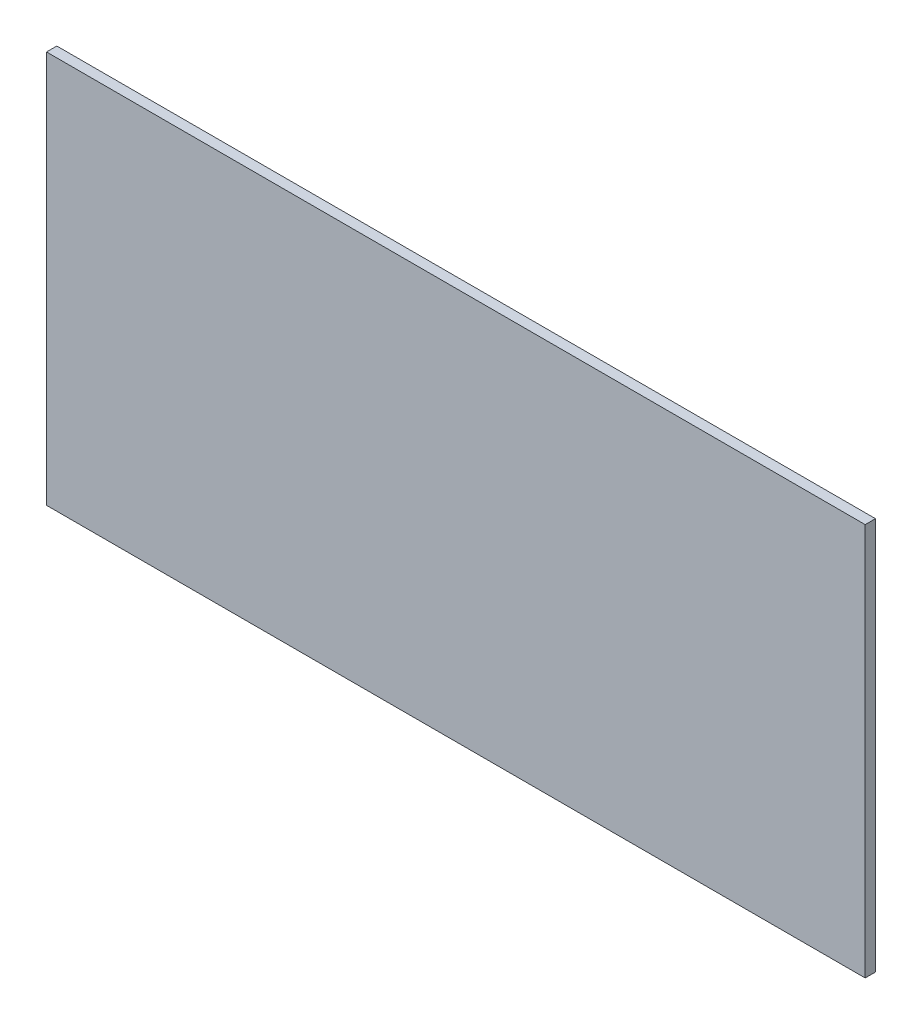
ISO-10303-21;
HEADER;
FILE_DESCRIPTION(('STEP AP214'),'2;1');
FILE_NAME('part.step','',(''),(''),'','','');
FILE_SCHEMA(('AUTOMOTIVE_DESIGN { 1 0 10303 214 1 1 1 1 }'));
ENDSEC;
DATA;
#1=APPLICATION_CONTEXT('core data for automotive mechanical design processes');
#2=APPLICATION_PROTOCOL_DEFINITION('international standard','automotive_design',2000,#1);
#3=PRODUCT_CONTEXT('',#1,'mechanical');
#4=PRODUCT('Part','Part','',(#3));
#5=PRODUCT_RELATED_PRODUCT_CATEGORY('part','',(#4));
#6=PRODUCT_DEFINITION_FORMATION('','',#4);
#7=PRODUCT_DEFINITION_CONTEXT('part definition',#1,'design');
#8=PRODUCT_DEFINITION('design','',#6,#7);
#9=PRODUCT_DEFINITION_SHAPE('','',#8);
#10=(LENGTH_UNIT() NAMED_UNIT(*) SI_UNIT(.MILLI.,.METRE.));
#11=(NAMED_UNIT(*) PLANE_ANGLE_UNIT() SI_UNIT($,.RADIAN.));
#12=(NAMED_UNIT(*) SI_UNIT($,.STERADIAN.) SOLID_ANGLE_UNIT());
#13=UNCERTAINTY_MEASURE_WITH_UNIT(LENGTH_MEASURE(1.E-05),#10,'distance_accuracy_value','');
#14=(GEOMETRIC_REPRESENTATION_CONTEXT(3) GLOBAL_UNCERTAINTY_ASSIGNED_CONTEXT((#13)) GLOBAL_UNIT_ASSIGNED_CONTEXT((#10,
#11,#12)) REPRESENTATION_CONTEXT('',''));
#15=CARTESIAN_POINT('',(0.,0.,0.));
#16=DIRECTION('',(0.,0.,1.));
#17=DIRECTION('',(1.,0.,0.));
#18=AXIS2_PLACEMENT_3D('',#15,#16,#17);
#19=CARTESIAN_POINT('',(0.,0.,-11.90625));
#20=DIRECTION('',(0.,0.,-1.));
#21=DIRECTION('',(-1.,0.,0.));
#22=AXIS2_PLACEMENT_3D('',#19,#20,#21);
#23=PLANE('',#22);
#24=DIRECTION('',(0.,-1.,0.));
#25=VECTOR('',#24,1.);
#26=CARTESIAN_POINT('',(-473.329414511646,454.025,-11.90625));
#27=LINE('',#26,#25);
#28=CARTESIAN_POINT('',(-473.329414511646,454.025,-11.90625));
#29=VERTEX_POINT('',#28);
#30=CARTESIAN_POINT('',(-473.329414511646,0.,-11.90625));
#31=VERTEX_POINT('',#30);
#32=EDGE_CURVE('E45',#29,#31,#27,.T.);
#33=ORIENTED_EDGE('',*,*,#32,.F.);
#34=DIRECTION('',(-1.,0.,0.));
#35=VECTOR('',#34,1.);
#36=CARTESIAN_POINT('',(-473.329414511646,454.025,-11.90625));
#37=LINE('',#36,#35);
#38=CARTESIAN_POINT('',(473.329414511646,454.025,-11.90625));
#39=VERTEX_POINT('',#38);
#40=EDGE_CURVE('E68',#39,#29,#37,.T.);
#41=ORIENTED_EDGE('',*,*,#40,.F.);
#42=DIRECTION('',(0.,1.,0.));
#43=VECTOR('',#42,1.);
#44=CARTESIAN_POINT('',(473.329414511646,454.025,-11.90625));
#45=LINE('',#44,#43);
#46=CARTESIAN_POINT('',(473.329414511646,0.,-11.90625));
#47=VERTEX_POINT('',#46);
#48=EDGE_CURVE('E73',#47,#39,#45,.T.);
#49=ORIENTED_EDGE('',*,*,#48,.F.);
#50=DIRECTION('',(1.,0.,0.));
#51=VECTOR('',#50,1.);
#52=CARTESIAN_POINT('',(-473.329414511646,0.,-11.90625));
#53=LINE('',#52,#51);
#54=EDGE_CURVE('E88',#31,#47,#53,.T.);
#55=ORIENTED_EDGE('',*,*,#54,.F.);
#56=EDGE_LOOP('',(#33,#41,#49,#55));
#57=FACE_BOUND('',#56,.T.);
#58=ADVANCED_FACE('F36',(#57),#23,.T.);
#59=CARTESIAN_POINT('',(0.,0.,0.));
#60=DIRECTION('',(0.,0.,1.));
#61=DIRECTION('',(1.,0.,0.));
#62=AXIS2_PLACEMENT_3D('',#59,#60,#61);
#63=PLANE('',#62);
#64=DIRECTION('',(0.,-1.,0.));
#65=VECTOR('',#64,1.);
#66=CARTESIAN_POINT('',(-473.329414511646,454.025,0.));
#67=LINE('',#66,#65);
#68=CARTESIAN_POINT('',(-473.329414511646,454.025,0.));
#69=VERTEX_POINT('',#68);
#70=CARTESIAN_POINT('',(-473.329414511646,0.,0.));
#71=VERTEX_POINT('',#70);
#72=EDGE_CURVE('E99',#69,#71,#67,.T.);
#73=ORIENTED_EDGE('',*,*,#72,.T.);
#74=DIRECTION('',(1.,0.,0.));
#75=VECTOR('',#74,1.);
#76=CARTESIAN_POINT('',(-473.329414511646,0.,0.));
#77=LINE('',#76,#75);
#78=CARTESIAN_POINT('',(473.329414511646,0.,0.));
#79=VERTEX_POINT('',#78);
#80=EDGE_CURVE('E86',#71,#79,#77,.T.);
#81=ORIENTED_EDGE('',*,*,#80,.T.);
#82=DIRECTION('',(0.,1.,0.));
#83=VECTOR('',#82,1.);
#84=CARTESIAN_POINT('',(473.329414511646,454.025,0.));
#85=LINE('',#84,#83);
#86=CARTESIAN_POINT('',(473.329414511646,454.025,0.));
#87=VERTEX_POINT('',#86);
#88=EDGE_CURVE('E90',#79,#87,#85,.T.);
#89=ORIENTED_EDGE('',*,*,#88,.T.);
#90=DIRECTION('',(-1.,0.,0.));
#91=VECTOR('',#90,1.);
#92=CARTESIAN_POINT('',(-473.329414511646,454.025,0.));
#93=LINE('',#92,#91);
#94=EDGE_CURVE('E96',#87,#69,#93,.T.);
#95=ORIENTED_EDGE('',*,*,#94,.T.);
#96=EDGE_LOOP('',(#73,#81,#89,#95));
#97=FACE_BOUND('',#96,.T.);
#98=ADVANCED_FACE('F98',(#97),#63,.T.);
#99=CARTESIAN_POINT('',(-473.329414511646,0.,-1061.81178822368));
#100=DIRECTION('',(0.,-1.,0.));
#101=DIRECTION('',(0.,0.,-1.));
#102=AXIS2_PLACEMENT_3D('',#99,#100,#101);
#103=PLANE('',#102);
#104=DIRECTION('',(0.,0.,1.));
#105=VECTOR('',#104,1.);
#106=CARTESIAN_POINT('',(-473.329414511646,0.,-1061.81178822368));
#107=LINE('',#106,#105);
#108=EDGE_CURVE('E11',#31,#71,#107,.T.);
#109=ORIENTED_EDGE('',*,*,#108,.F.);
#110=ORIENTED_EDGE('',*,*,#54,.T.);
#111=DIRECTION('',(0.,0.,1.));
#112=VECTOR('',#111,1.);
#113=CARTESIAN_POINT('',(473.329414511646,0.,-1061.81178822368));
#114=LINE('',#113,#112);
#115=EDGE_CURVE('E83',#47,#79,#114,.T.);
#116=ORIENTED_EDGE('',*,*,#115,.T.);
#117=ORIENTED_EDGE('',*,*,#80,.F.);
#118=EDGE_LOOP('',(#109,#110,#116,#117));
#119=FACE_BOUND('',#118,.T.);
#120=ADVANCED_FACE('F84',(#119),#103,.T.);
#121=CARTESIAN_POINT('',(473.329414511646,454.025,-1061.81178822368));
#122=DIRECTION('',(1.,0.,0.));
#123=DIRECTION('',(0.,0.,-1.));
#124=AXIS2_PLACEMENT_3D('',#121,#122,#123);
#125=PLANE('',#124);
#126=ORIENTED_EDGE('',*,*,#115,.F.);
#127=ORIENTED_EDGE('',*,*,#48,.T.);
#128=DIRECTION('',(0.,0.,1.));
#129=VECTOR('',#128,1.);
#130=CARTESIAN_POINT('',(473.329414511646,454.025,-1061.81178822368));
#131=LINE('',#130,#129);
#132=EDGE_CURVE('E78',#39,#87,#131,.T.);
#133=ORIENTED_EDGE('',*,*,#132,.T.);
#134=ORIENTED_EDGE('',*,*,#88,.F.);
#135=EDGE_LOOP('',(#126,#127,#133,#134));
#136=FACE_BOUND('',#135,.T.);
#137=ADVANCED_FACE('F91',(#136),#125,.T.);
#138=CARTESIAN_POINT('',(-473.329414511646,454.025,-1061.81178822368));
#139=DIRECTION('',(0.,1.,0.));
#140=DIRECTION('',(0.,0.,1.));
#141=AXIS2_PLACEMENT_3D('',#138,#139,#140);
#142=PLANE('',#141);
#143=ORIENTED_EDGE('',*,*,#132,.F.);
#144=ORIENTED_EDGE('',*,*,#40,.T.);
#145=DIRECTION('',(0.,0.,1.));
#146=VECTOR('',#145,1.);
#147=CARTESIAN_POINT('',(-473.329414511646,454.025,-1061.81178822368));
#148=LINE('',#147,#146);
#149=EDGE_CURVE('E111',#29,#69,#148,.T.);
#150=ORIENTED_EDGE('',*,*,#149,.T.);
#151=ORIENTED_EDGE('',*,*,#94,.F.);
#152=EDGE_LOOP('',(#143,#144,#150,#151));
#153=FACE_BOUND('',#152,.T.);
#154=ADVANCED_FACE('F128',(#153),#142,.T.);
#155=CARTESIAN_POINT('',(-473.329414511646,454.025,-1061.81178822368));
#156=DIRECTION('',(-1.,0.,0.));
#157=DIRECTION('',(0.,0.,1.));
#158=AXIS2_PLACEMENT_3D('',#155,#156,#157);
#159=PLANE('',#158);
#160=ORIENTED_EDGE('',*,*,#149,.F.);
#161=ORIENTED_EDGE('',*,*,#32,.T.);
#162=ORIENTED_EDGE('',*,*,#108,.T.);
#163=ORIENTED_EDGE('',*,*,#72,.F.);
#164=EDGE_LOOP('',(#160,#161,#162,#163));
#165=FACE_BOUND('',#164,.T.);
#166=ADVANCED_FACE('F130',(#165),#159,.T.);
#167=CLOSED_SHELL('',(#58,#98,#120,#137,#154,#166));
#168=MANIFOLD_SOLID_BREP('B2',#167);
#169=ADVANCED_BREP_SHAPE_REPRESENTATION('',(#18,#168),#14);
#170=SHAPE_DEFINITION_REPRESENTATION(#9,#169);
ENDSEC;
END-ISO-10303-21;
